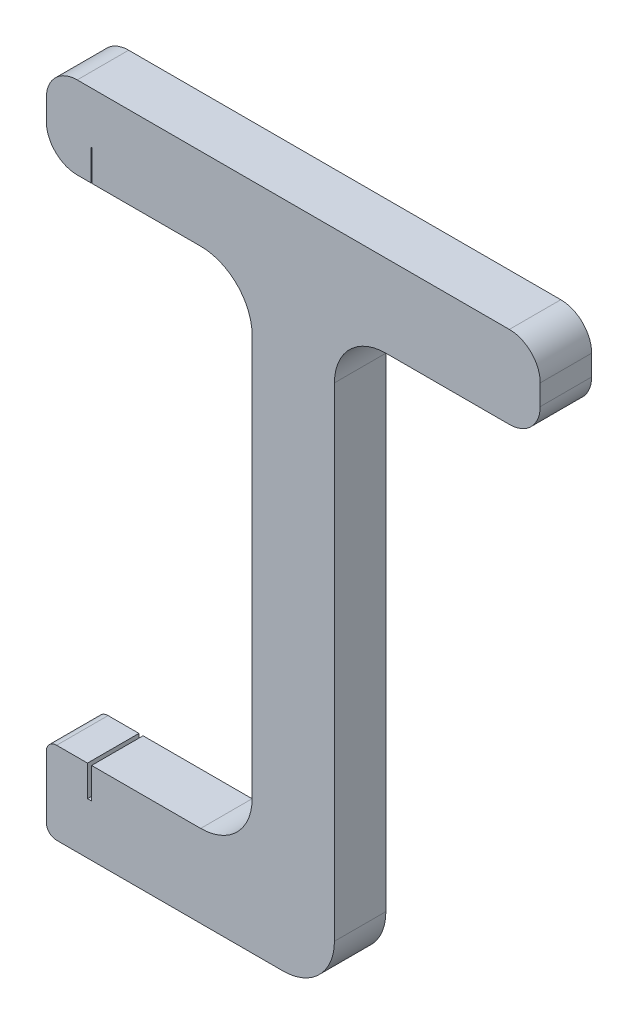
ISO-10303-21;
HEADER;
FILE_DESCRIPTION(('STEP AP214'),'2;1');
FILE_NAME('part.step','',(''),(''),'','','');
FILE_SCHEMA(('AUTOMOTIVE_DESIGN { 1 0 10303 214 1 1 1 1 }'));
ENDSEC;
DATA;
#1=APPLICATION_CONTEXT('core data for automotive mechanical design processes');
#2=APPLICATION_PROTOCOL_DEFINITION('international standard','automotive_design',2000,#1);
#3=PRODUCT_CONTEXT('',#1,'mechanical');
#4=PRODUCT('Part','Part','',(#3));
#5=PRODUCT_RELATED_PRODUCT_CATEGORY('part','',(#4));
#6=PRODUCT_DEFINITION_FORMATION('','',#4);
#7=PRODUCT_DEFINITION_CONTEXT('part definition',#1,'design');
#8=PRODUCT_DEFINITION('design','',#6,#7);
#9=PRODUCT_DEFINITION_SHAPE('','',#8);
#10=(LENGTH_UNIT() NAMED_UNIT(*) SI_UNIT(.MILLI.,.METRE.));
#11=(NAMED_UNIT(*) PLANE_ANGLE_UNIT() SI_UNIT($,.RADIAN.));
#12=(NAMED_UNIT(*) SI_UNIT($,.STERADIAN.) SOLID_ANGLE_UNIT());
#13=UNCERTAINTY_MEASURE_WITH_UNIT(LENGTH_MEASURE(1.E-05),#10,'distance_accuracy_value','');
#14=(GEOMETRIC_REPRESENTATION_CONTEXT(3) GLOBAL_UNCERTAINTY_ASSIGNED_CONTEXT((#13)) GLOBAL_UNIT_ASSIGNED_CONTEXT((#10,
#11,#12)) REPRESENTATION_CONTEXT('',''));
#15=CARTESIAN_POINT('',(0.,0.,0.));
#16=DIRECTION('',(0.,0.,1.));
#17=DIRECTION('',(1.,0.,0.));
#18=AXIS2_PLACEMENT_3D('',#15,#16,#17);
#19=CARTESIAN_POINT('',(-28.,57.,5.));
#20=DIRECTION('',(0.,1.,0.));
#21=DIRECTION('',(0.,0.,1.));
#22=AXIS2_PLACEMENT_3D('',#19,#20,#21);
#23=PLANE('',#22);
#24=DIRECTION('',(1.,0.,0.));
#25=VECTOR('',#24,1.);
#26=CARTESIAN_POINT('',(-28.,57.,0.));
#27=LINE('',#26,#25);
#28=CARTESIAN_POINT('',(-23.55,57.,0.));
#29=VERTEX_POINT('',#28);
#30=CARTESIAN_POINT('',(-13.,57.,0.));
#31=VERTEX_POINT('',#30);
#32=EDGE_CURVE('E332',#29,#31,#27,.T.);
#33=ORIENTED_EDGE('',*,*,#32,.T.);
#34=DIRECTION('',(0.,0.,-1.));
#35=VECTOR('',#34,1.);
#36=CARTESIAN_POINT('',(-13.,57.,5.));
#37=LINE('',#36,#35);
#38=CARTESIAN_POINT('',(-13.,57.,5.));
#39=VERTEX_POINT('',#38);
#40=EDGE_CURVE('E367',#31,#39,#37,.F.);
#41=ORIENTED_EDGE('',*,*,#40,.T.);
#42=DIRECTION('',(1.,0.,0.));
#43=VECTOR('',#42,1.);
#44=CARTESIAN_POINT('',(-28.,57.,5.));
#45=LINE('',#44,#43);
#46=CARTESIAN_POINT('',(-23.55,57.,4.99999999999999));
#47=VERTEX_POINT('',#46);
#48=EDGE_CURVE('E304',#47,#39,#45,.T.);
#49=ORIENTED_EDGE('',*,*,#48,.F.);
#50=DIRECTION('',(0.,0.,1.));
#51=VECTOR('',#50,1.);
#52=CARTESIAN_POINT('',(-23.55,57.,4.99999999999999));
#53=LINE('',#52,#51);
#54=EDGE_CURVE('E227',#29,#47,#53,.T.);
#55=ORIENTED_EDGE('',*,*,#54,.F.);
#56=EDGE_LOOP('',(#33,#41,#49,#55));
#57=FACE_BOUND('',#56,.T.);
#58=ADVANCED_FACE('F35',(#57),#23,.F.);
#59=CARTESIAN_POINT('',(-7.99999999999999,8.,5.));
#60=DIRECTION('',(0.,-1.,0.));
#61=DIRECTION('',(1.,0.,0.));
#62=AXIS2_PLACEMENT_3D('',#59,#60,#61);
#63=PLANE('',#62);
#64=DIRECTION('',(-1.,0.,0.));
#65=VECTOR('',#64,1.);
#66=CARTESIAN_POINT('',(-7.99999999999999,8.,5.));
#67=LINE('',#66,#65);
#68=CARTESIAN_POINT('',(-13.,8.,5.));
#69=VERTEX_POINT('',#68);
#70=CARTESIAN_POINT('',(-23.6,8.,5.));
#71=VERTEX_POINT('',#70);
#72=EDGE_CURVE('E311',#69,#71,#67,.T.);
#73=ORIENTED_EDGE('',*,*,#72,.F.);
#74=DIRECTION('',(0.,0.,-1.));
#75=VECTOR('',#74,1.);
#76=CARTESIAN_POINT('',(-13.,8.,0.));
#77=LINE('',#76,#75);
#78=CARTESIAN_POINT('',(-13.,8.,0.));
#79=VERTEX_POINT('',#78);
#80=EDGE_CURVE('E356',#69,#79,#77,.T.);
#81=ORIENTED_EDGE('',*,*,#80,.T.);
#82=DIRECTION('',(-1.,0.,0.));
#83=VECTOR('',#82,1.);
#84=CARTESIAN_POINT('',(-7.99999999999999,8.,0.));
#85=LINE('',#84,#83);
#86=CARTESIAN_POINT('',(-23.6,8.,0.));
#87=VERTEX_POINT('',#86);
#88=EDGE_CURVE('E339',#79,#87,#85,.T.);
#89=ORIENTED_EDGE('',*,*,#88,.T.);
#90=DIRECTION('',(0.,0.,-1.));
#91=VECTOR('',#90,1.);
#92=CARTESIAN_POINT('',(-23.6,8.,5.));
#93=LINE('',#92,#91);
#94=EDGE_CURVE('E256',#71,#87,#93,.T.);
#95=ORIENTED_EDGE('',*,*,#94,.F.);
#96=EDGE_LOOP('',(#73,#81,#89,#95));
#97=FACE_BOUND('',#96,.T.);
#98=ADVANCED_FACE('F464',(#97),#63,.F.);
#99=CARTESIAN_POINT('',(0.,0.,5.));
#100=DIRECTION('',(-1.,0.,0.));
#101=DIRECTION('',(0.,0.,1.));
#102=AXIS2_PLACEMENT_3D('',#99,#100,#101);
#103=PLANE('',#102);
#104=DIRECTION('',(0.,1.,0.));
#105=VECTOR('',#104,1.);
#106=CARTESIAN_POINT('',(0.,0.,5.));
#107=LINE('',#106,#105);
#108=CARTESIAN_POINT('',(0.,5.,5.));
#109=VERTEX_POINT('',#108);
#110=CARTESIAN_POINT('',(0.,52.,5.));
#111=VERTEX_POINT('',#110);
#112=EDGE_CURVE('E288',#109,#111,#107,.T.);
#113=ORIENTED_EDGE('',*,*,#112,.F.);
#114=DIRECTION('',(0.,0.,-1.));
#115=VECTOR('',#114,1.);
#116=CARTESIAN_POINT('',(0.,5.,5.));
#117=LINE('',#116,#115);
#118=CARTESIAN_POINT('',(0.,5.,0.));
#119=VERTEX_POINT('',#118);
#120=EDGE_CURVE('E345',#109,#119,#117,.T.);
#121=ORIENTED_EDGE('',*,*,#120,.T.);
#122=DIRECTION('',(0.,1.,0.));
#123=VECTOR('',#122,1.);
#124=CARTESIAN_POINT('',(0.,0.,0.));
#125=LINE('',#124,#123);
#126=CARTESIAN_POINT('',(0.,52.,0.));
#127=VERTEX_POINT('',#126);
#128=EDGE_CURVE('E280',#119,#127,#125,.T.);
#129=ORIENTED_EDGE('',*,*,#128,.T.);
#130=DIRECTION('',(0.,0.,-1.));
#131=VECTOR('',#130,1.);
#132=CARTESIAN_POINT('',(0.,52.,5.));
#133=LINE('',#132,#131);
#134=EDGE_CURVE('E317',#127,#111,#133,.F.);
#135=ORIENTED_EDGE('',*,*,#134,.T.);
#136=EDGE_LOOP('',(#113,#121,#129,#135));
#137=FACE_BOUND('',#136,.T.);
#138=ADVANCED_FACE('F488',(#137),#103,.F.);
#139=CARTESIAN_POINT('',(0.,57.,5.));
#140=DIRECTION('',(0.,1.,0.));
#141=DIRECTION('',(0.,0.,1.));
#142=AXIS2_PLACEMENT_3D('',#139,#140,#141);
#143=PLANE('',#142);
#144=DIRECTION('',(1.,0.,0.));
#145=VECTOR('',#144,1.);
#146=CARTESIAN_POINT('',(0.,57.,0.));
#147=LINE('',#146,#145);
#148=CARTESIAN_POINT('',(5.,57.,0.));
#149=VERTEX_POINT('',#148);
#150=CARTESIAN_POINT('',(17.,57.,0.));
#151=VERTEX_POINT('',#150);
#152=EDGE_CURVE('E320',#149,#151,#147,.T.);
#153=ORIENTED_EDGE('',*,*,#152,.T.);
#154=DIRECTION('',(0.,0.,-1.));
#155=VECTOR('',#154,1.);
#156=CARTESIAN_POINT('',(17.,57.,5.));
#157=LINE('',#156,#155);
#158=CARTESIAN_POINT('',(17.,57.,5.));
#159=VERTEX_POINT('',#158);
#160=EDGE_CURVE('E394',#151,#159,#157,.F.);
#161=ORIENTED_EDGE('',*,*,#160,.T.);
#162=DIRECTION('',(1.,0.,0.));
#163=VECTOR('',#162,1.);
#164=CARTESIAN_POINT('',(0.,57.,5.));
#165=LINE('',#164,#163);
#166=CARTESIAN_POINT('',(5.,57.,5.));
#167=VERTEX_POINT('',#166);
#168=EDGE_CURVE('E291',#167,#159,#165,.T.);
#169=ORIENTED_EDGE('',*,*,#168,.F.);
#170=DIRECTION('',(0.,0.,-1.));
#171=VECTOR('',#170,1.);
#172=CARTESIAN_POINT('',(5.,57.,0.));
#173=LINE('',#172,#171);
#174=EDGE_CURVE('E364',#167,#149,#173,.T.);
#175=ORIENTED_EDGE('',*,*,#174,.T.);
#176=EDGE_LOOP('',(#153,#161,#169,#175));
#177=FACE_BOUND('',#176,.T.);
#178=ADVANCED_FACE('F535',(#177),#143,.F.);
#179=CARTESIAN_POINT('',(20.,57.,5.));
#180=DIRECTION('',(-1.,0.,0.));
#181=DIRECTION('',(0.,0.,1.));
#182=AXIS2_PLACEMENT_3D('',#179,#180,#181);
#183=PLANE('',#182);
#184=DIRECTION('',(0.,1.,0.));
#185=VECTOR('',#184,1.);
#186=CARTESIAN_POINT('',(20.,57.,5.));
#187=LINE('',#186,#185);
#188=CARTESIAN_POINT('',(20.,60.,5.));
#189=VERTEX_POINT('',#188);
#190=CARTESIAN_POINT('',(20.,62.,5.));
#191=VERTEX_POINT('',#190);
#192=EDGE_CURVE('E295',#189,#191,#187,.T.);
#193=ORIENTED_EDGE('',*,*,#192,.F.);
#194=DIRECTION('',(0.,0.,-1.));
#195=VECTOR('',#194,1.);
#196=CARTESIAN_POINT('',(20.,60.,5.));
#197=LINE('',#196,#195);
#198=CARTESIAN_POINT('',(20.,60.,0.));
#199=VERTEX_POINT('',#198);
#200=EDGE_CURVE('E383',#189,#199,#197,.T.);
#201=ORIENTED_EDGE('',*,*,#200,.T.);
#202=DIRECTION('',(0.,1.,0.));
#203=VECTOR('',#202,1.);
#204=CARTESIAN_POINT('',(20.,57.,0.));
#205=LINE('',#204,#203);
#206=CARTESIAN_POINT('',(20.,62.,0.));
#207=VERTEX_POINT('',#206);
#208=EDGE_CURVE('E323',#199,#207,#205,.T.);
#209=ORIENTED_EDGE('',*,*,#208,.T.);
#210=DIRECTION('',(0.,0.,-1.));
#211=VECTOR('',#210,1.);
#212=CARTESIAN_POINT('',(20.,62.,5.));
#213=LINE('',#212,#211);
#214=EDGE_CURVE('E381',#207,#191,#213,.F.);
#215=ORIENTED_EDGE('',*,*,#214,.T.);
#216=EDGE_LOOP('',(#193,#201,#209,#215));
#217=FACE_BOUND('',#216,.T.);
#218=ADVANCED_FACE('F527',(#217),#183,.F.);
#219=CARTESIAN_POINT('',(0.,65.,5.));
#220=DIRECTION('',(0.,-1.,0.));
#221=DIRECTION('',(0.,0.,-1.));
#222=AXIS2_PLACEMENT_3D('',#219,#220,#221);
#223=PLANE('',#222);
#224=DIRECTION('',(-1.,0.,0.));
#225=VECTOR('',#224,1.);
#226=CARTESIAN_POINT('',(20.,65.,5.));
#227=LINE('',#226,#225);
#228=CARTESIAN_POINT('',(17.,65.,5.));
#229=VERTEX_POINT('',#228);
#230=CARTESIAN_POINT('',(-25.,65.,5.));
#231=VERTEX_POINT('',#230);
#232=EDGE_CURVE('E298',#229,#231,#227,.T.);
#233=ORIENTED_EDGE('',*,*,#232,.F.);
#234=DIRECTION('',(0.,0.,-1.));
#235=VECTOR('',#234,1.);
#236=CARTESIAN_POINT('',(17.,65.,5.));
#237=LINE('',#236,#235);
#238=CARTESIAN_POINT('',(17.,65.,0.));
#239=VERTEX_POINT('',#238);
#240=EDGE_CURVE('E406',#229,#239,#237,.T.);
#241=ORIENTED_EDGE('',*,*,#240,.T.);
#242=DIRECTION('',(-1.,0.,0.));
#243=VECTOR('',#242,1.);
#244=CARTESIAN_POINT('',(0.,65.,0.));
#245=LINE('',#244,#243);
#246=CARTESIAN_POINT('',(-25.,65.,0.));
#247=VERTEX_POINT('',#246);
#248=EDGE_CURVE('E326',#239,#247,#245,.T.);
#249=ORIENTED_EDGE('',*,*,#248,.T.);
#250=DIRECTION('',(0.,0.,-1.));
#251=VECTOR('',#250,1.);
#252=CARTESIAN_POINT('',(-25.,65.,5.));
#253=LINE('',#252,#251);
#254=EDGE_CURVE('E404',#247,#231,#253,.F.);
#255=ORIENTED_EDGE('',*,*,#254,.T.);
#256=EDGE_LOOP('',(#233,#241,#249,#255));
#257=FACE_BOUND('',#256,.T.);
#258=ADVANCED_FACE('F499',(#257),#223,.F.);
#259=CARTESIAN_POINT('',(-28.,65.,5.));
#260=DIRECTION('',(1.,0.,0.));
#261=DIRECTION('',(0.,0.,-1.));
#262=AXIS2_PLACEMENT_3D('',#259,#260,#261);
#263=PLANE('',#262);
#264=DIRECTION('',(0.,-1.,0.));
#265=VECTOR('',#264,1.);
#266=CARTESIAN_POINT('',(-28.,65.,5.));
#267=LINE('',#266,#265);
#268=CARTESIAN_POINT('',(-28.,62.,5.));
#269=VERTEX_POINT('',#268);
#270=CARTESIAN_POINT('',(-28.,60.,5.));
#271=VERTEX_POINT('',#270);
#272=EDGE_CURVE('E301',#269,#271,#267,.T.);
#273=ORIENTED_EDGE('',*,*,#272,.F.);
#274=DIRECTION('',(0.,0.,-1.));
#275=VECTOR('',#274,1.);
#276=CARTESIAN_POINT('',(-28.,62.,5.));
#277=LINE('',#276,#275);
#278=CARTESIAN_POINT('',(-28.,62.,0.));
#279=VERTEX_POINT('',#278);
#280=EDGE_CURVE('E411',#269,#279,#277,.T.);
#281=ORIENTED_EDGE('',*,*,#280,.T.);
#282=DIRECTION('',(0.,-1.,0.));
#283=VECTOR('',#282,1.);
#284=CARTESIAN_POINT('',(-28.,65.,0.));
#285=LINE('',#284,#283);
#286=CARTESIAN_POINT('',(-28.,60.,0.));
#287=VERTEX_POINT('',#286);
#288=EDGE_CURVE('E329',#279,#287,#285,.T.);
#289=ORIENTED_EDGE('',*,*,#288,.T.);
#290=DIRECTION('',(0.,0.,-1.));
#291=VECTOR('',#290,1.);
#292=CARTESIAN_POINT('',(-28.,60.,5.));
#293=LINE('',#292,#291);
#294=EDGE_CURVE('E409',#287,#271,#293,.F.);
#295=ORIENTED_EDGE('',*,*,#294,.T.);
#296=EDGE_LOOP('',(#273,#281,#289,#295));
#297=FACE_BOUND('',#296,.T.);
#298=ADVANCED_FACE('F493',(#297),#263,.F.);
#299=CARTESIAN_POINT('',(-25.,57.,5.));
#300=VERTEX_POINT('',#299);
#301=CARTESIAN_POINT('',(-23.65,57.,4.99999999999999));
#302=VERTEX_POINT('',#301);
#303=EDGE_CURVE('E305',#300,#302,#45,.T.);
#304=ORIENTED_EDGE('',*,*,#303,.F.);
#305=DIRECTION('',(0.,0.,-1.));
#306=VECTOR('',#305,1.);
#307=CARTESIAN_POINT('',(-25.,57.,5.));
#308=LINE('',#307,#306);
#309=CARTESIAN_POINT('',(-25.,57.,0.));
#310=VERTEX_POINT('',#309);
#311=EDGE_CURVE('E414',#300,#310,#308,.T.);
#312=ORIENTED_EDGE('',*,*,#311,.T.);
#313=CARTESIAN_POINT('',(-23.65,57.,0.));
#314=VERTEX_POINT('',#313);
#315=EDGE_CURVE('E333',#310,#314,#27,.T.);
#316=ORIENTED_EDGE('',*,*,#315,.T.);
#317=DIRECTION('',(0.,0.,-1.));
#318=VECTOR('',#317,1.);
#319=CARTESIAN_POINT('',(-23.65,57.,4.99999999999999));
#320=LINE('',#319,#318);
#321=EDGE_CURVE('E242',#302,#314,#320,.T.);
#322=ORIENTED_EDGE('',*,*,#321,.F.);
#323=EDGE_LOOP('',(#304,#312,#316,#322));
#324=FACE_BOUND('',#323,.T.);
#325=ADVANCED_FACE('F484',(#324),#23,.F.);
#326=CARTESIAN_POINT('',(-8.,57.,5.));
#327=DIRECTION('',(1.,0.,0.));
#328=DIRECTION('',(0.,1.,0.));
#329=AXIS2_PLACEMENT_3D('',#326,#327,#328);
#330=PLANE('',#329);
#331=DIRECTION('',(0.,-1.,0.));
#332=VECTOR('',#331,1.);
#333=CARTESIAN_POINT('',(-8.,57.,0.));
#334=LINE('',#333,#332);
#335=CARTESIAN_POINT('',(-8.,52.,0.));
#336=VERTEX_POINT('',#335);
#337=CARTESIAN_POINT('',(-7.99999999999999,13.,0.));
#338=VERTEX_POINT('',#337);
#339=EDGE_CURVE('E335',#336,#338,#334,.T.);
#340=ORIENTED_EDGE('',*,*,#339,.T.);
#341=DIRECTION('',(0.,0.,-1.));
#342=VECTOR('',#341,1.);
#343=CARTESIAN_POINT('',(-7.99999999999999,13.,5.));
#344=LINE('',#343,#342);
#345=CARTESIAN_POINT('',(-7.99999999999999,13.,5.));
#346=VERTEX_POINT('',#345);
#347=EDGE_CURVE('E362',#338,#346,#344,.F.);
#348=ORIENTED_EDGE('',*,*,#347,.T.);
#349=DIRECTION('',(0.,-1.,0.));
#350=VECTOR('',#349,1.);
#351=CARTESIAN_POINT('',(-8.,57.,5.));
#352=LINE('',#351,#350);
#353=CARTESIAN_POINT('',(-8.,52.,5.));
#354=VERTEX_POINT('',#353);
#355=EDGE_CURVE('E307',#354,#346,#352,.T.);
#356=ORIENTED_EDGE('',*,*,#355,.F.);
#357=DIRECTION('',(0.,0.,-1.));
#358=VECTOR('',#357,1.);
#359=CARTESIAN_POINT('',(-8.,52.,0.));
#360=LINE('',#359,#358);
#361=EDGE_CURVE('E359',#354,#336,#360,.T.);
#362=ORIENTED_EDGE('',*,*,#361,.T.);
#363=EDGE_LOOP('',(#340,#348,#356,#362));
#364=FACE_BOUND('',#363,.T.);
#365=ADVANCED_FACE('F472',(#364),#330,.F.);
#366=CARTESIAN_POINT('',(-24.,8.,0.));
#367=VERTEX_POINT('',#366);
#368=CARTESIAN_POINT('',(-27.,8.,0.));
#369=VERTEX_POINT('',#368);
#370=EDGE_CURVE('E338',#367,#369,#85,.T.);
#371=ORIENTED_EDGE('',*,*,#370,.T.);
#372=DIRECTION('',(0.,0.,-1.));
#373=VECTOR('',#372,1.);
#374=CARTESIAN_POINT('',(-27.,8.,5.));
#375=LINE('',#374,#373);
#376=CARTESIAN_POINT('',(-27.,8.,5.));
#377=VERTEX_POINT('',#376);
#378=EDGE_CURVE('E12',#369,#377,#375,.F.);
#379=ORIENTED_EDGE('',*,*,#378,.T.);
#380=CARTESIAN_POINT('',(-24.,8.,5.));
#381=VERTEX_POINT('',#380);
#382=EDGE_CURVE('E310',#381,#377,#67,.T.);
#383=ORIENTED_EDGE('',*,*,#382,.F.);
#384=DIRECTION('',(0.,0.,1.));
#385=VECTOR('',#384,1.);
#386=CARTESIAN_POINT('',(-24.,8.,5.));
#387=LINE('',#386,#385);
#388=EDGE_CURVE('E264',#367,#381,#387,.T.);
#389=ORIENTED_EDGE('',*,*,#388,.F.);
#390=EDGE_LOOP('',(#371,#379,#383,#389));
#391=FACE_BOUND('',#390,.T.);
#392=ADVANCED_FACE('F449',(#391),#63,.F.);
#393=CARTESIAN_POINT('',(-28.,8.,5.));
#394=DIRECTION('',(1.,0.,0.));
#395=DIRECTION('',(0.,0.,-1.));
#396=AXIS2_PLACEMENT_3D('',#393,#394,#395);
#397=PLANE('',#396);
#398=DIRECTION('',(0.,-1.,0.));
#399=VECTOR('',#398,1.);
#400=CARTESIAN_POINT('',(-28.,8.,0.));
#401=LINE('',#400,#399);
#402=CARTESIAN_POINT('',(-28.,7.,0.));
#403=VERTEX_POINT('',#402);
#404=CARTESIAN_POINT('',(-28.,1.,0.));
#405=VERTEX_POINT('',#404);
#406=EDGE_CURVE('E341',#403,#405,#401,.T.);
#407=ORIENTED_EDGE('',*,*,#406,.T.);
#408=DIRECTION('',(0.,0.,-1.));
#409=VECTOR('',#408,1.);
#410=CARTESIAN_POINT('',(-28.,1.,5.));
#411=LINE('',#410,#409);
#412=CARTESIAN_POINT('',(-28.,1.,5.));
#413=VERTEX_POINT('',#412);
#414=EDGE_CURVE('E56',#405,#413,#411,.F.);
#415=ORIENTED_EDGE('',*,*,#414,.T.);
#416=DIRECTION('',(0.,-1.,0.));
#417=VECTOR('',#416,1.);
#418=CARTESIAN_POINT('',(-28.,8.,5.));
#419=LINE('',#418,#417);
#420=CARTESIAN_POINT('',(-28.,7.,5.));
#421=VERTEX_POINT('',#420);
#422=EDGE_CURVE('E313',#421,#413,#419,.T.);
#423=ORIENTED_EDGE('',*,*,#422,.F.);
#424=DIRECTION('',(0.,0.,-1.));
#425=VECTOR('',#424,1.);
#426=CARTESIAN_POINT('',(-28.,7.,5.));
#427=LINE('',#426,#425);
#428=EDGE_CURVE('E424',#421,#403,#427,.T.);
#429=ORIENTED_EDGE('',*,*,#428,.T.);
#430=EDGE_LOOP('',(#407,#415,#423,#429));
#431=FACE_BOUND('',#430,.T.);
#432=ADVANCED_FACE('F442',(#431),#397,.F.);
#433=CARTESIAN_POINT('',(-28.,0.,5.));
#434=DIRECTION('',(0.,1.,0.));
#435=DIRECTION('',(-1.,0.,0.));
#436=AXIS2_PLACEMENT_3D('',#433,#434,#435);
#437=PLANE('',#436);
#438=DIRECTION('',(1.,0.,0.));
#439=VECTOR('',#438,1.);
#440=CARTESIAN_POINT('',(-28.,0.,5.));
#441=LINE('',#440,#439);
#442=CARTESIAN_POINT('',(-27.,0.,5.));
#443=VERTEX_POINT('',#442);
#444=CARTESIAN_POINT('',(-5.00000000000001,0.,5.));
#445=VERTEX_POINT('',#444);
#446=EDGE_CURVE('E315',#443,#445,#441,.T.);
#447=ORIENTED_EDGE('',*,*,#446,.F.);
#448=DIRECTION('',(0.,0.,-1.));
#449=VECTOR('',#448,1.);
#450=CARTESIAN_POINT('',(-27.,0.,5.));
#451=LINE('',#450,#449);
#452=CARTESIAN_POINT('',(-27.,0.,0.));
#453=VERTEX_POINT('',#452);
#454=EDGE_CURVE('E417',#443,#453,#451,.T.);
#455=ORIENTED_EDGE('',*,*,#454,.T.);
#456=DIRECTION('',(1.,0.,0.));
#457=VECTOR('',#456,1.);
#458=CARTESIAN_POINT('',(-28.,0.,0.));
#459=LINE('',#458,#457);
#460=CARTESIAN_POINT('',(-5.00000000000001,0.,0.));
#461=VERTEX_POINT('',#460);
#462=EDGE_CURVE('E292',#453,#461,#459,.T.);
#463=ORIENTED_EDGE('',*,*,#462,.T.);
#464=DIRECTION('',(0.,0.,-1.));
#465=VECTOR('',#464,1.);
#466=CARTESIAN_POINT('',(-5.,0.,5.));
#467=LINE('',#466,#465);
#468=EDGE_CURVE('E351',#461,#445,#467,.F.);
#469=ORIENTED_EDGE('',*,*,#468,.T.);
#470=EDGE_LOOP('',(#447,#455,#463,#469));
#471=FACE_BOUND('',#470,.T.);
#472=ADVANCED_FACE('F434',(#471),#437,.F.);
#473=CARTESIAN_POINT('',(0.,0.,5.));
#474=DIRECTION('',(0.,0.,-1.));
#475=DIRECTION('',(-1.,0.,0.));
#476=AXIS2_PLACEMENT_3D('',#473,#474,#475);
#477=PLANE('',#476);
#478=ORIENTED_EDGE('',*,*,#422,.T.);
#479=CARTESIAN_POINT('',(-27.,1.,5.));
#480=DIRECTION('',(0.,0.,-1.));
#481=DIRECTION('',(-1.,0.,0.));
#482=AXIS2_PLACEMENT_3D('',#479,#480,#481);
#483=CIRCLE('',#482,1.);
#484=EDGE_CURVE('E43',#413,#443,#483,.F.);
#485=ORIENTED_EDGE('',*,*,#484,.T.);
#486=ORIENTED_EDGE('',*,*,#446,.T.);
#487=CARTESIAN_POINT('',(-5.,5.,5.));
#488=DIRECTION('',(0.,0.,-1.));
#489=DIRECTION('',(-1.,0.,0.));
#490=AXIS2_PLACEMENT_3D('',#487,#488,#489);
#491=CIRCLE('',#490,5.);
#492=EDGE_CURVE('E354',#445,#109,#491,.F.);
#493=ORIENTED_EDGE('',*,*,#492,.T.);
#494=ORIENTED_EDGE('',*,*,#112,.T.);
#495=CARTESIAN_POINT('',(5.,52.,5.));
#496=DIRECTION('',(0.,0.,-1.));
#497=DIRECTION('',(-1.,0.,0.));
#498=AXIS2_PLACEMENT_3D('',#495,#496,#497);
#499=CIRCLE('',#498,5.);
#500=EDGE_CURVE('E375',#111,#167,#499,.T.);
#501=ORIENTED_EDGE('',*,*,#500,.T.);
#502=ORIENTED_EDGE('',*,*,#168,.T.);
#503=CARTESIAN_POINT('',(17.,60.,5.));
#504=DIRECTION('',(0.,0.,-1.));
#505=DIRECTION('',(-1.,0.,0.));
#506=AXIS2_PLACEMENT_3D('',#503,#504,#505);
#507=CIRCLE('',#506,3.);
#508=EDGE_CURVE('E402',#159,#189,#507,.F.);
#509=ORIENTED_EDGE('',*,*,#508,.T.);
#510=ORIENTED_EDGE('',*,*,#192,.T.);
#511=CARTESIAN_POINT('',(17.,62.,5.));
#512=DIRECTION('',(0.,0.,-1.));
#513=DIRECTION('',(-1.,0.,0.));
#514=AXIS2_PLACEMENT_3D('',#511,#512,#513);
#515=CIRCLE('',#514,3.);
#516=EDGE_CURVE('E400',#191,#229,#515,.F.);
#517=ORIENTED_EDGE('',*,*,#516,.T.);
#518=ORIENTED_EDGE('',*,*,#232,.T.);
#519=CARTESIAN_POINT('',(-25.,62.,5.));
#520=DIRECTION('',(0.,0.,-1.));
#521=DIRECTION('',(-1.,0.,0.));
#522=AXIS2_PLACEMENT_3D('',#519,#520,#521);
#523=CIRCLE('',#522,3.);
#524=EDGE_CURVE('E398',#231,#269,#523,.F.);
#525=ORIENTED_EDGE('',*,*,#524,.T.);
#526=ORIENTED_EDGE('',*,*,#272,.T.);
#527=CARTESIAN_POINT('',(-25.,60.,5.));
#528=DIRECTION('',(0.,0.,-1.));
#529=DIRECTION('',(-1.,0.,0.));
#530=AXIS2_PLACEMENT_3D('',#527,#528,#529);
#531=CIRCLE('',#530,3.);
#532=EDGE_CURVE('E396',#271,#300,#531,.F.);
#533=ORIENTED_EDGE('',*,*,#532,.T.);
#534=ORIENTED_EDGE('',*,*,#303,.T.);
#535=DIRECTION('',(0.,-1.,0.));
#536=VECTOR('',#535,1.);
#537=CARTESIAN_POINT('',(-23.65,60.,4.99999999999999));
#538=LINE('',#537,#536);
#539=CARTESIAN_POINT('',(-23.65,60.,4.99999999999999));
#540=VERTEX_POINT('',#539);
#541=EDGE_CURVE('E232',#540,#302,#538,.T.);
#542=ORIENTED_EDGE('',*,*,#541,.F.);
#543=DIRECTION('',(-1.,0.,0.));
#544=VECTOR('',#543,1.);
#545=CARTESIAN_POINT('',(-23.65,60.,4.99999999999999));
#546=LINE('',#545,#544);
#547=CARTESIAN_POINT('',(-23.55,60.,4.99999999999999));
#548=VERTEX_POINT('',#547);
#549=EDGE_CURVE('E238',#548,#540,#546,.T.);
#550=ORIENTED_EDGE('',*,*,#549,.F.);
#551=DIRECTION('',(0.,-1.,0.));
#552=VECTOR('',#551,1.);
#553=CARTESIAN_POINT('',(-23.55,60.,4.99999999999999));
#554=LINE('',#553,#552);
#555=EDGE_CURVE('E221',#548,#47,#554,.T.);
#556=ORIENTED_EDGE('',*,*,#555,.T.);
#557=ORIENTED_EDGE('',*,*,#48,.T.);
#558=CARTESIAN_POINT('',(-13.,52.,5.));
#559=DIRECTION('',(0.,0.,-1.));
#560=DIRECTION('',(-1.,0.,0.));
#561=AXIS2_PLACEMENT_3D('',#558,#559,#560);
#562=CIRCLE('',#561,5.);
#563=EDGE_CURVE('E379',#39,#354,#562,.T.);
#564=ORIENTED_EDGE('',*,*,#563,.T.);
#565=ORIENTED_EDGE('',*,*,#355,.T.);
#566=CARTESIAN_POINT('',(-13.,13.,5.));
#567=DIRECTION('',(0.,0.,-1.));
#568=DIRECTION('',(-1.,0.,0.));
#569=AXIS2_PLACEMENT_3D('',#566,#567,#568);
#570=CIRCLE('',#569,5.);
#571=EDGE_CURVE('E371',#346,#69,#570,.T.);
#572=ORIENTED_EDGE('',*,*,#571,.T.);
#573=ORIENTED_EDGE('',*,*,#72,.T.);
#574=DIRECTION('',(0.,1.,0.));
#575=VECTOR('',#574,1.);
#576=CARTESIAN_POINT('',(-23.6,5.,5.));
#577=LINE('',#576,#575);
#578=CARTESIAN_POINT('',(-23.6,5.,5.));
#579=VERTEX_POINT('',#578);
#580=EDGE_CURVE('E277',#579,#71,#577,.T.);
#581=ORIENTED_EDGE('',*,*,#580,.F.);
#582=DIRECTION('',(1.,0.,0.));
#583=VECTOR('',#582,1.);
#584=CARTESIAN_POINT('',(-24.,5.,5.));
#585=LINE('',#584,#583);
#586=CARTESIAN_POINT('',(-24.,5.,5.));
#587=VERTEX_POINT('',#586);
#588=EDGE_CURVE('E270',#587,#579,#585,.T.);
#589=ORIENTED_EDGE('',*,*,#588,.F.);
#590=DIRECTION('',(0.,1.,0.));
#591=VECTOR('',#590,1.);
#592=CARTESIAN_POINT('',(-24.,5.,5.));
#593=LINE('',#592,#591);
#594=EDGE_CURVE('E281',#587,#381,#593,.T.);
#595=ORIENTED_EDGE('',*,*,#594,.T.);
#596=ORIENTED_EDGE('',*,*,#382,.T.);
#597=CARTESIAN_POINT('',(-27.,7.,5.));
#598=DIRECTION('',(0.,0.,-1.));
#599=DIRECTION('',(-1.,0.,0.));
#600=AXIS2_PLACEMENT_3D('',#597,#598,#599);
#601=CIRCLE('',#600,1.);
#602=EDGE_CURVE('E428',#377,#421,#601,.F.);
#603=ORIENTED_EDGE('',*,*,#602,.T.);
#604=EDGE_LOOP('',(#478,#485,#486,#493,#494,#501,#502,#509,#510,#517,#518,#525,#526,#533,#534,
#542,#550,#556,#557,#564,#565,#572,#573,#581,#589,#595,#596,#603));
#605=FACE_BOUND('',#604,.T.);
#606=ADVANCED_FACE('F244',(#605),#477,.F.);
#607=CARTESIAN_POINT('',(0.,0.,0.));
#608=DIRECTION('',(0.,0.,-1.));
#609=DIRECTION('',(-1.,0.,0.));
#610=AXIS2_PLACEMENT_3D('',#607,#608,#609);
#611=PLANE('',#610);
#612=ORIENTED_EDGE('',*,*,#462,.F.);
#613=CARTESIAN_POINT('',(-27.,1.,0.));
#614=DIRECTION('',(0.,0.,-1.));
#615=DIRECTION('',(-1.,0.,0.));
#616=AXIS2_PLACEMENT_3D('',#613,#614,#615);
#617=CIRCLE('',#616,1.);
#618=EDGE_CURVE('E422',#453,#405,#617,.T.);
#619=ORIENTED_EDGE('',*,*,#618,.T.);
#620=ORIENTED_EDGE('',*,*,#406,.F.);
#621=CARTESIAN_POINT('',(-27.,7.,0.));
#622=DIRECTION('',(0.,0.,-1.));
#623=DIRECTION('',(-1.,0.,0.));
#624=AXIS2_PLACEMENT_3D('',#621,#622,#623);
#625=CIRCLE('',#624,1.);
#626=EDGE_CURVE('E420',#403,#369,#625,.T.);
#627=ORIENTED_EDGE('',*,*,#626,.T.);
#628=ORIENTED_EDGE('',*,*,#370,.F.);
#629=DIRECTION('',(0.,1.,0.));
#630=VECTOR('',#629,1.);
#631=CARTESIAN_POINT('',(-24.,5.,0.));
#632=LINE('',#631,#630);
#633=CARTESIAN_POINT('',(-24.,5.,0.));
#634=VERTEX_POINT('',#633);
#635=EDGE_CURVE('E284',#634,#367,#632,.T.);
#636=ORIENTED_EDGE('',*,*,#635,.F.);
#637=DIRECTION('',(-1.,0.,0.));
#638=VECTOR('',#637,1.);
#639=CARTESIAN_POINT('',(-24.,5.,0.));
#640=LINE('',#639,#638);
#641=CARTESIAN_POINT('',(-23.6,5.,0.));
#642=VERTEX_POINT('',#641);
#643=EDGE_CURVE('E263',#642,#634,#640,.T.);
#644=ORIENTED_EDGE('',*,*,#643,.F.);
#645=DIRECTION('',(0.,1.,0.));
#646=VECTOR('',#645,1.);
#647=CARTESIAN_POINT('',(-23.6,5.,0.));
#648=LINE('',#647,#646);
#649=EDGE_CURVE('E273',#642,#87,#648,.T.);
#650=ORIENTED_EDGE('',*,*,#649,.T.);
#651=ORIENTED_EDGE('',*,*,#88,.F.);
#652=CARTESIAN_POINT('',(-13.,13.,0.));
#653=DIRECTION('',(0.,0.,-1.));
#654=DIRECTION('',(-1.,0.,0.));
#655=AXIS2_PLACEMENT_3D('',#652,#653,#654);
#656=CIRCLE('',#655,5.);
#657=EDGE_CURVE('E369',#79,#338,#656,.F.);
#658=ORIENTED_EDGE('',*,*,#657,.T.);
#659=ORIENTED_EDGE('',*,*,#339,.F.);
#660=CARTESIAN_POINT('',(-13.,52.,0.));
#661=DIRECTION('',(0.,0.,-1.));
#662=DIRECTION('',(-1.,0.,0.));
#663=AXIS2_PLACEMENT_3D('',#660,#661,#662);
#664=CIRCLE('',#663,5.);
#665=EDGE_CURVE('E377',#336,#31,#664,.F.);
#666=ORIENTED_EDGE('',*,*,#665,.T.);
#667=ORIENTED_EDGE('',*,*,#32,.F.);
#668=DIRECTION('',(0.,-1.,0.));
#669=VECTOR('',#668,1.);
#670=CARTESIAN_POINT('',(-23.55,60.,0.));
#671=LINE('',#670,#669);
#672=CARTESIAN_POINT('',(-23.55,60.,0.));
#673=VERTEX_POINT('',#672);
#674=EDGE_CURVE('E254',#673,#29,#671,.T.);
#675=ORIENTED_EDGE('',*,*,#674,.F.);
#676=DIRECTION('',(1.,0.,0.));
#677=VECTOR('',#676,1.);
#678=CARTESIAN_POINT('',(-23.65,60.,0.));
#679=LINE('',#678,#677);
#680=CARTESIAN_POINT('',(-23.65,60.,0.));
#681=VERTEX_POINT('',#680);
#682=EDGE_CURVE('E233',#681,#673,#679,.T.);
#683=ORIENTED_EDGE('',*,*,#682,.F.);
#684=DIRECTION('',(0.,-1.,0.));
#685=VECTOR('',#684,1.);
#686=CARTESIAN_POINT('',(-23.65,60.,0.));
#687=LINE('',#686,#685);
#688=EDGE_CURVE('E257',#681,#314,#687,.T.);
#689=ORIENTED_EDGE('',*,*,#688,.T.);
#690=ORIENTED_EDGE('',*,*,#315,.F.);
#691=CARTESIAN_POINT('',(-25.,60.,0.));
#692=DIRECTION('',(0.,0.,-1.));
#693=DIRECTION('',(-1.,0.,0.));
#694=AXIS2_PLACEMENT_3D('',#691,#692,#693);
#695=CIRCLE('',#694,3.);
#696=EDGE_CURVE('E386',#310,#287,#695,.T.);
#697=ORIENTED_EDGE('',*,*,#696,.T.);
#698=ORIENTED_EDGE('',*,*,#288,.F.);
#699=CARTESIAN_POINT('',(-25.,62.,0.));
#700=DIRECTION('',(0.,0.,-1.));
#701=DIRECTION('',(-1.,0.,0.));
#702=AXIS2_PLACEMENT_3D('',#699,#700,#701);
#703=CIRCLE('',#702,3.);
#704=EDGE_CURVE('E388',#279,#247,#703,.T.);
#705=ORIENTED_EDGE('',*,*,#704,.T.);
#706=ORIENTED_EDGE('',*,*,#248,.F.);
#707=CARTESIAN_POINT('',(17.,62.,0.));
#708=DIRECTION('',(0.,0.,-1.));
#709=DIRECTION('',(-1.,0.,0.));
#710=AXIS2_PLACEMENT_3D('',#707,#708,#709);
#711=CIRCLE('',#710,3.);
#712=EDGE_CURVE('E390',#239,#207,#711,.T.);
#713=ORIENTED_EDGE('',*,*,#712,.T.);
#714=ORIENTED_EDGE('',*,*,#208,.F.);
#715=CARTESIAN_POINT('',(17.,60.,0.));
#716=DIRECTION('',(0.,0.,-1.));
#717=DIRECTION('',(-1.,0.,0.));
#718=AXIS2_PLACEMENT_3D('',#715,#716,#717);
#719=CIRCLE('',#718,3.);
#720=EDGE_CURVE('E392',#199,#151,#719,.T.);
#721=ORIENTED_EDGE('',*,*,#720,.T.);
#722=ORIENTED_EDGE('',*,*,#152,.F.);
#723=CARTESIAN_POINT('',(5.,52.,0.));
#724=DIRECTION('',(0.,0.,-1.));
#725=DIRECTION('',(-1.,0.,0.));
#726=AXIS2_PLACEMENT_3D('',#723,#724,#725);
#727=CIRCLE('',#726,5.);
#728=EDGE_CURVE('E373',#149,#127,#727,.F.);
#729=ORIENTED_EDGE('',*,*,#728,.T.);
#730=ORIENTED_EDGE('',*,*,#128,.F.);
#731=CARTESIAN_POINT('',(-5.,5.,0.));
#732=DIRECTION('',(0.,0.,-1.));
#733=DIRECTION('',(-1.,0.,0.));
#734=AXIS2_PLACEMENT_3D('',#731,#732,#733);
#735=CIRCLE('',#734,5.);
#736=EDGE_CURVE('E348',#119,#461,#735,.T.);
#737=ORIENTED_EDGE('',*,*,#736,.T.);
#738=EDGE_LOOP('',(#612,#619,#620,#627,#628,#636,#644,#650,#651,#658,#659,#666,#667,#675,#683,
#689,#690,#697,#698,#705,#706,#713,#714,#721,#722,#729,#730,#737));
#739=FACE_BOUND('',#738,.T.);
#740=ADVANCED_FACE('F441',(#739),#611,.T.);
#741=CARTESIAN_POINT('',(-23.6,5.,5.));
#742=DIRECTION('',(1.,0.,0.));
#743=DIRECTION('',(0.,1.,0.));
#744=AXIS2_PLACEMENT_3D('',#741,#742,#743);
#745=PLANE('',#744);
#746=ORIENTED_EDGE('',*,*,#94,.T.);
#747=ORIENTED_EDGE('',*,*,#649,.F.);
#748=DIRECTION('',(0.,0.,-1.));
#749=VECTOR('',#748,1.);
#750=CARTESIAN_POINT('',(-23.6,5.,5.));
#751=LINE('',#750,#749);
#752=EDGE_CURVE('E261',#579,#642,#751,.T.);
#753=ORIENTED_EDGE('',*,*,#752,.F.);
#754=ORIENTED_EDGE('',*,*,#580,.T.);
#755=EDGE_LOOP('',(#746,#747,#753,#754));
#756=FACE_BOUND('',#755,.T.);
#757=ADVANCED_FACE('F460',(#756),#745,.F.);
#758=CARTESIAN_POINT('',(-24.,5.,5.));
#759=DIRECTION('',(-1.,0.,0.));
#760=DIRECTION('',(0.,-1.,0.));
#761=AXIS2_PLACEMENT_3D('',#758,#759,#760);
#762=PLANE('',#761);
#763=ORIENTED_EDGE('',*,*,#388,.T.);
#764=ORIENTED_EDGE('',*,*,#594,.F.);
#765=DIRECTION('',(0.,0.,1.));
#766=VECTOR('',#765,1.);
#767=CARTESIAN_POINT('',(-24.,5.,5.));
#768=LINE('',#767,#766);
#769=EDGE_CURVE('E267',#634,#587,#768,.T.);
#770=ORIENTED_EDGE('',*,*,#769,.F.);
#771=ORIENTED_EDGE('',*,*,#635,.T.);
#772=EDGE_LOOP('',(#763,#764,#770,#771));
#773=FACE_BOUND('',#772,.T.);
#774=ADVANCED_FACE('F451',(#773),#762,.F.);
#775=CARTESIAN_POINT('',(0.,5.,0.));
#776=DIRECTION('',(0.,-1.,0.));
#777=DIRECTION('',(0.,0.,-1.));
#778=AXIS2_PLACEMENT_3D('',#775,#776,#777);
#779=PLANE('',#778);
#780=ORIENTED_EDGE('',*,*,#752,.T.);
#781=ORIENTED_EDGE('',*,*,#643,.T.);
#782=ORIENTED_EDGE('',*,*,#769,.T.);
#783=ORIENTED_EDGE('',*,*,#588,.T.);
#784=EDGE_LOOP('',(#780,#781,#782,#783));
#785=FACE_BOUND('',#784,.T.);
#786=ADVANCED_FACE('F455',(#785),#779,.F.);
#787=CARTESIAN_POINT('',(-23.55,60.,4.99999999999999));
#788=DIRECTION('',(1.,0.,0.));
#789=DIRECTION('',(0.,0.,-1.));
#790=AXIS2_PLACEMENT_3D('',#787,#788,#789);
#791=PLANE('',#790);
#792=ORIENTED_EDGE('',*,*,#54,.T.);
#793=ORIENTED_EDGE('',*,*,#555,.F.);
#794=DIRECTION('',(0.,0.,1.));
#795=VECTOR('',#794,1.);
#796=CARTESIAN_POINT('',(-23.55,60.,4.99999999999999));
#797=LINE('',#796,#795);
#798=EDGE_CURVE('E224',#673,#548,#797,.T.);
#799=ORIENTED_EDGE('',*,*,#798,.F.);
#800=ORIENTED_EDGE('',*,*,#674,.T.);
#801=EDGE_LOOP('',(#792,#793,#799,#800));
#802=FACE_BOUND('',#801,.T.);
#803=ADVANCED_FACE('F223',(#802),#791,.F.);
#804=CARTESIAN_POINT('',(-23.65,60.,4.99999999999999));
#805=DIRECTION('',(-1.,0.,0.));
#806=DIRECTION('',(0.,0.,1.));
#807=AXIS2_PLACEMENT_3D('',#804,#805,#806);
#808=PLANE('',#807);
#809=ORIENTED_EDGE('',*,*,#321,.T.);
#810=ORIENTED_EDGE('',*,*,#688,.F.);
#811=DIRECTION('',(0.,0.,-1.));
#812=VECTOR('',#811,1.);
#813=CARTESIAN_POINT('',(-23.65,60.,4.99999999999999));
#814=LINE('',#813,#812);
#815=EDGE_CURVE('E246',#540,#681,#814,.T.);
#816=ORIENTED_EDGE('',*,*,#815,.F.);
#817=ORIENTED_EDGE('',*,*,#541,.T.);
#818=EDGE_LOOP('',(#809,#810,#816,#817));
#819=FACE_BOUND('',#818,.T.);
#820=ADVANCED_FACE('F555',(#819),#808,.F.);
#821=CARTESIAN_POINT('',(0.,60.,0.));
#822=DIRECTION('',(0.,-1.,0.));
#823=DIRECTION('',(0.,0.,-1.));
#824=AXIS2_PLACEMENT_3D('',#821,#822,#823);
#825=PLANE('',#824);
#826=ORIENTED_EDGE('',*,*,#798,.T.);
#827=ORIENTED_EDGE('',*,*,#549,.T.);
#828=ORIENTED_EDGE('',*,*,#815,.T.);
#829=ORIENTED_EDGE('',*,*,#682,.T.);
#830=EDGE_LOOP('',(#826,#827,#828,#829));
#831=FACE_BOUND('',#830,.T.);
#832=ADVANCED_FACE('F237',(#831),#825,.T.);
#833=CARTESIAN_POINT('',(-5.,5.,5.));
#834=DIRECTION('',(0.,0.,-1.));
#835=DIRECTION('',(-1.,0.,0.));
#836=AXIS2_PLACEMENT_3D('',#833,#834,#835);
#837=CYLINDRICAL_SURFACE('',#836,5.);
#838=ORIENTED_EDGE('',*,*,#492,.F.);
#839=ORIENTED_EDGE('',*,*,#468,.F.);
#840=ORIENTED_EDGE('',*,*,#736,.F.);
#841=ORIENTED_EDGE('',*,*,#120,.F.);
#842=EDGE_LOOP('',(#838,#839,#840,#841));
#843=FACE_BOUND('',#842,.T.);
#844=ADVANCED_FACE('F547',(#843),#837,.T.);
#845=CARTESIAN_POINT('',(-13.,13.,5.));
#846=DIRECTION('',(0.,0.,1.));
#847=DIRECTION('',(1.,0.,0.));
#848=AXIS2_PLACEMENT_3D('',#845,#846,#847);
#849=CYLINDRICAL_SURFACE('',#848,5.);
#850=ORIENTED_EDGE('',*,*,#571,.F.);
#851=ORIENTED_EDGE('',*,*,#347,.F.);
#852=ORIENTED_EDGE('',*,*,#657,.F.);
#853=ORIENTED_EDGE('',*,*,#80,.F.);
#854=EDGE_LOOP('',(#850,#851,#852,#853));
#855=FACE_BOUND('',#854,.T.);
#856=ADVANCED_FACE('F468',(#855),#849,.F.);
#857=CARTESIAN_POINT('',(5.,52.,5.));
#858=DIRECTION('',(0.,0.,1.));
#859=DIRECTION('',(1.,0.,0.));
#860=AXIS2_PLACEMENT_3D('',#857,#858,#859);
#861=CYLINDRICAL_SURFACE('',#860,5.);
#862=ORIENTED_EDGE('',*,*,#500,.F.);
#863=ORIENTED_EDGE('',*,*,#134,.F.);
#864=ORIENTED_EDGE('',*,*,#728,.F.);
#865=ORIENTED_EDGE('',*,*,#174,.F.);
#866=EDGE_LOOP('',(#862,#863,#864,#865));
#867=FACE_BOUND('',#866,.T.);
#868=ADVANCED_FACE('F540',(#867),#861,.F.);
#869=CARTESIAN_POINT('',(-13.,52.,5.));
#870=DIRECTION('',(0.,0.,1.));
#871=DIRECTION('',(1.,0.,0.));
#872=AXIS2_PLACEMENT_3D('',#869,#870,#871);
#873=CYLINDRICAL_SURFACE('',#872,5.);
#874=ORIENTED_EDGE('',*,*,#563,.F.);
#875=ORIENTED_EDGE('',*,*,#40,.F.);
#876=ORIENTED_EDGE('',*,*,#665,.F.);
#877=ORIENTED_EDGE('',*,*,#361,.F.);
#878=EDGE_LOOP('',(#874,#875,#876,#877));
#879=FACE_BOUND('',#878,.T.);
#880=ADVANCED_FACE('F477',(#879),#873,.F.);
#881=CARTESIAN_POINT('',(17.,60.,5.));
#882=DIRECTION('',(0.,0.,-1.));
#883=DIRECTION('',(-1.,0.,0.));
#884=AXIS2_PLACEMENT_3D('',#881,#882,#883);
#885=CYLINDRICAL_SURFACE('',#884,3.);
#886=ORIENTED_EDGE('',*,*,#508,.F.);
#887=ORIENTED_EDGE('',*,*,#160,.F.);
#888=ORIENTED_EDGE('',*,*,#720,.F.);
#889=ORIENTED_EDGE('',*,*,#200,.F.);
#890=EDGE_LOOP('',(#886,#887,#888,#889));
#891=FACE_BOUND('',#890,.T.);
#892=ADVANCED_FACE('F531',(#891),#885,.T.);
#893=CARTESIAN_POINT('',(17.,62.,5.));
#894=DIRECTION('',(0.,0.,-1.));
#895=DIRECTION('',(-1.,0.,0.));
#896=AXIS2_PLACEMENT_3D('',#893,#894,#895);
#897=CYLINDRICAL_SURFACE('',#896,3.);
#898=ORIENTED_EDGE('',*,*,#516,.F.);
#899=ORIENTED_EDGE('',*,*,#214,.F.);
#900=ORIENTED_EDGE('',*,*,#712,.F.);
#901=ORIENTED_EDGE('',*,*,#240,.F.);
#902=EDGE_LOOP('',(#898,#899,#900,#901));
#903=FACE_BOUND('',#902,.T.);
#904=ADVANCED_FACE('F522',(#903),#897,.T.);
#905=CARTESIAN_POINT('',(-25.,62.,5.));
#906=DIRECTION('',(0.,0.,-1.));
#907=DIRECTION('',(-1.,0.,0.));
#908=AXIS2_PLACEMENT_3D('',#905,#906,#907);
#909=CYLINDRICAL_SURFACE('',#908,3.);
#910=ORIENTED_EDGE('',*,*,#524,.F.);
#911=ORIENTED_EDGE('',*,*,#254,.F.);
#912=ORIENTED_EDGE('',*,*,#704,.F.);
#913=ORIENTED_EDGE('',*,*,#280,.F.);
#914=EDGE_LOOP('',(#910,#911,#912,#913));
#915=FACE_BOUND('',#914,.T.);
#916=ADVANCED_FACE('F514',(#915),#909,.T.);
#917=CARTESIAN_POINT('',(-25.,60.,5.));
#918=DIRECTION('',(0.,0.,-1.));
#919=DIRECTION('',(-1.,0.,0.));
#920=AXIS2_PLACEMENT_3D('',#917,#918,#919);
#921=CYLINDRICAL_SURFACE('',#920,3.);
#922=ORIENTED_EDGE('',*,*,#532,.F.);
#923=ORIENTED_EDGE('',*,*,#294,.F.);
#924=ORIENTED_EDGE('',*,*,#696,.F.);
#925=ORIENTED_EDGE('',*,*,#311,.F.);
#926=EDGE_LOOP('',(#922,#923,#924,#925));
#927=FACE_BOUND('',#926,.T.);
#928=ADVANCED_FACE('F507',(#927),#921,.T.);
#929=CARTESIAN_POINT('',(-27.,1.,5.));
#930=DIRECTION('',(0.,0.,-1.));
#931=DIRECTION('',(-1.,0.,0.));
#932=AXIS2_PLACEMENT_3D('',#929,#930,#931);
#933=CYLINDRICAL_SURFACE('',#932,1.);
#934=ORIENTED_EDGE('',*,*,#484,.F.);
#935=ORIENTED_EDGE('',*,*,#414,.F.);
#936=ORIENTED_EDGE('',*,*,#618,.F.);
#937=ORIENTED_EDGE('',*,*,#454,.F.);
#938=EDGE_LOOP('',(#934,#935,#936,#937));
#939=FACE_BOUND('',#938,.T.);
#940=ADVANCED_FACE('F438',(#939),#933,.T.);
#941=CARTESIAN_POINT('',(-27.,7.,5.));
#942=DIRECTION('',(0.,0.,-1.));
#943=DIRECTION('',(-1.,0.,0.));
#944=AXIS2_PLACEMENT_3D('',#941,#942,#943);
#945=CYLINDRICAL_SURFACE('',#944,1.);
#946=ORIENTED_EDGE('',*,*,#602,.F.);
#947=ORIENTED_EDGE('',*,*,#378,.F.);
#948=ORIENTED_EDGE('',*,*,#626,.F.);
#949=ORIENTED_EDGE('',*,*,#428,.F.);
#950=EDGE_LOOP('',(#946,#947,#948,#949));
#951=FACE_BOUND('',#950,.T.);
#952=ADVANCED_FACE('F37',(#951),#945,.T.);
#953=CLOSED_SHELL('',(#58,#98,#138,#178,#218,#258,#298,#325,#365,#392,#432,#472,#606,#740,#757,
#774,#786,#803,#820,#832,#844,#856,#868,#880,#892,#904,#916,#928,#940,#952));
#954=MANIFOLD_SOLID_BREP('B2',#953);
#955=ADVANCED_BREP_SHAPE_REPRESENTATION('',(#18,#954),#14);
#956=SHAPE_DEFINITION_REPRESENTATION(#9,#955);
ENDSEC;
END-ISO-10303-21;
